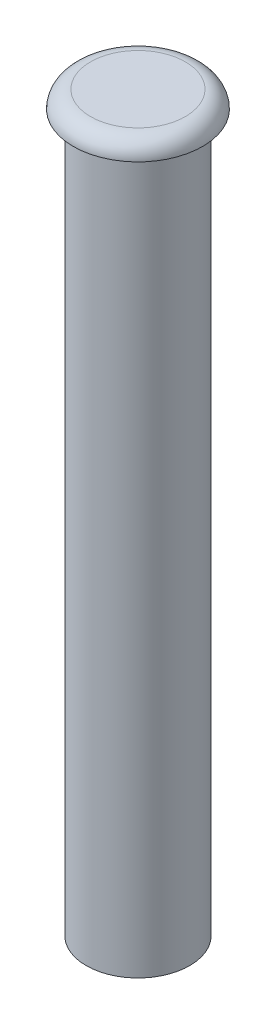
ISO-10303-21;
HEADER;
FILE_DESCRIPTION(('STEP AP214'),'2;1');
FILE_NAME('part.step','',(''),(''),'','','');
FILE_SCHEMA(('AUTOMOTIVE_DESIGN { 1 0 10303 214 1 1 1 1 }'));
ENDSEC;
DATA;
#1=APPLICATION_CONTEXT('core data for automotive mechanical design processes');
#2=APPLICATION_PROTOCOL_DEFINITION('international standard','automotive_design',2000,#1);
#3=PRODUCT_CONTEXT('',#1,'mechanical');
#4=PRODUCT('Part','Part','',(#3));
#5=PRODUCT_RELATED_PRODUCT_CATEGORY('part','',(#4));
#6=PRODUCT_DEFINITION_FORMATION('','',#4);
#7=PRODUCT_DEFINITION_CONTEXT('part definition',#1,'design');
#8=PRODUCT_DEFINITION('design','',#6,#7);
#9=PRODUCT_DEFINITION_SHAPE('','',#8);
#10=(LENGTH_UNIT() NAMED_UNIT(*) SI_UNIT(.MILLI.,.METRE.));
#11=(NAMED_UNIT(*) PLANE_ANGLE_UNIT() SI_UNIT($,.RADIAN.));
#12=(NAMED_UNIT(*) SI_UNIT($,.STERADIAN.) SOLID_ANGLE_UNIT());
#13=UNCERTAINTY_MEASURE_WITH_UNIT(LENGTH_MEASURE(1.E-05),#10,'distance_accuracy_value','');
#14=(GEOMETRIC_REPRESENTATION_CONTEXT(3) GLOBAL_UNCERTAINTY_ASSIGNED_CONTEXT((#13)) GLOBAL_UNIT_ASSIGNED_CONTEXT((#10,
#11,#12)) REPRESENTATION_CONTEXT('',''));
#15=CARTESIAN_POINT('',(0.,0.,0.));
#16=DIRECTION('',(0.,0.,1.));
#17=DIRECTION('',(1.,0.,0.));
#18=AXIS2_PLACEMENT_3D('',#15,#16,#17);
#19=CARTESIAN_POINT('',(0.,83.,0.));
#20=DIRECTION('',(0.,-1.,0.));
#21=DIRECTION('',(0.,0.,-1.));
#22=AXIS2_PLACEMENT_3D('',#19,#20,#21);
#23=CYLINDRICAL_SURFACE('',#22,6.);
#24=CARTESIAN_POINT('',(0.,83.,0.));
#25=DIRECTION('',(0.,1.,0.));
#26=DIRECTION('',(0.,0.,1.));
#27=AXIS2_PLACEMENT_3D('',#24,#25,#26);
#28=CIRCLE('',#27,6.);
#29=CARTESIAN_POINT('',(0.,83.,6.));
#30=VERTEX_POINT('',#29);
#31=EDGE_CURVE('E49',#30,#30,#28,.T.);
#32=ORIENTED_EDGE('',*,*,#31,.F.);
#33=EDGE_LOOP('',(#32));
#34=FACE_BOUND('',#33,.T.);
#35=CARTESIAN_POINT('',(0.,0.,0.));
#36=DIRECTION('',(0.,1.,0.));
#37=DIRECTION('',(0.,0.,1.));
#38=AXIS2_PLACEMENT_3D('',#35,#36,#37);
#39=CIRCLE('',#38,6.);
#40=CARTESIAN_POINT('',(0.,0.,6.));
#41=VERTEX_POINT('',#40);
#42=EDGE_CURVE('E54',#41,#41,#39,.T.);
#43=ORIENTED_EDGE('',*,*,#42,.T.);
#44=EDGE_LOOP('',(#43));
#45=FACE_BOUND('',#44,.T.);
#46=ADVANCED_FACE('F41',(#34,#45),#23,.T.);
#47=CARTESIAN_POINT('',(0.,0.,0.));
#48=DIRECTION('',(0.,1.,0.));
#49=DIRECTION('',(0.,0.,1.));
#50=AXIS2_PLACEMENT_3D('',#47,#48,#49);
#51=PLANE('',#50);
#52=CARTESIAN_POINT('',(0.,0.,0.));
#53=DIRECTION('',(0.,-1.,0.));
#54=DIRECTION('',(0.,0.,-1.));
#55=AXIS2_PLACEMENT_3D('',#52,#53,#54);
#56=CIRCLE('',#55,2.);
#57=CARTESIAN_POINT('',(0.,0.,-2.));
#58=VERTEX_POINT('',#57);
#59=EDGE_CURVE('E66',#58,#58,#56,.T.);
#60=ORIENTED_EDGE('',*,*,#59,.F.);
#61=EDGE_LOOP('',(#60));
#62=FACE_BOUND('',#61,.T.);
#63=ORIENTED_EDGE('',*,*,#42,.F.);
#64=EDGE_LOOP('',(#63));
#65=FACE_BOUND('',#64,.T.);
#66=ADVANCED_FACE('F82',(#62,#65),#51,.F.);
#67=CARTESIAN_POINT('',(0.,85.,0.));
#68=DIRECTION('',(0.,1.,0.));
#69=DIRECTION('',(0.,0.,1.));
#70=AXIS2_PLACEMENT_3D('',#67,#68,#69);
#71=PLANE('',#70);
#72=CARTESIAN_POINT('',(0.,85.,0.));
#73=DIRECTION('',(0.,1.,0.));
#74=DIRECTION('',(0.,0.,1.));
#75=AXIS2_PLACEMENT_3D('',#72,#73,#74);
#76=CIRCLE('',#75,5.5);
#77=CARTESIAN_POINT('',(0.,85.,5.5));
#78=VERTEX_POINT('',#77);
#79=EDGE_CURVE('E10',#78,#78,#76,.T.);
#80=ORIENTED_EDGE('',*,*,#79,.T.);
#81=EDGE_LOOP('',(#80));
#82=FACE_BOUND('',#81,.T.);
#83=ADVANCED_FACE('F85',(#82),#71,.T.);
#84=CARTESIAN_POINT('',(0.,83.,0.));
#85=DIRECTION('',(0.,1.,0.));
#86=DIRECTION('',(0.,0.,1.));
#87=AXIS2_PLACEMENT_3D('',#84,#85,#86);
#88=PLANE('',#87);
#89=ORIENTED_EDGE('',*,*,#31,.T.);
#90=EDGE_LOOP('',(#89));
#91=FACE_BOUND('',#90,.T.);
#92=CARTESIAN_POINT('',(0.,83.,0.));
#93=DIRECTION('',(0.,1.,0.));
#94=DIRECTION('',(0.,0.,1.));
#95=AXIS2_PLACEMENT_3D('',#92,#93,#94);
#96=CIRCLE('',#95,7.5);
#97=CARTESIAN_POINT('',(0.,83.,7.5));
#98=VERTEX_POINT('',#97);
#99=EDGE_CURVE('E60',#98,#98,#96,.T.);
#100=ORIENTED_EDGE('',*,*,#99,.F.);
#101=EDGE_LOOP('',(#100));
#102=FACE_BOUND('',#101,.T.);
#103=ADVANCED_FACE('F94',(#91,#102),#88,.F.);
#104=CARTESIAN_POINT('',(0.,83.,0.));
#105=DIRECTION('',(0.,1.,0.));
#106=DIRECTION('',(0.,0.,1.));
#107=AXIS2_PLACEMENT_3D('',#104,#105,#106);
#108=TOROIDAL_SURFACE('',#107,5.5,2.);
#109=ORIENTED_EDGE('',*,*,#99,.T.);
#110=EDGE_LOOP('',(#109));
#111=FACE_BOUND('',#110,.T.);
#112=ORIENTED_EDGE('',*,*,#79,.F.);
#113=EDGE_LOOP('',(#112));
#114=FACE_BOUND('',#113,.T.);
#115=ADVANCED_FACE('F43',(#111,#114),#108,.T.);
#116=CARTESIAN_POINT('',(0.,5.,0.));
#117=DIRECTION('',(0.,-1.,0.));
#118=DIRECTION('',(0.,0.,-1.));
#119=AXIS2_PLACEMENT_3D('',#116,#117,#118);
#120=CYLINDRICAL_SURFACE('',#119,2.);
#121=CARTESIAN_POINT('',(0.,5.,0.));
#122=DIRECTION('',(0.,-1.,0.));
#123=DIRECTION('',(0.,0.,-1.));
#124=AXIS2_PLACEMENT_3D('',#121,#122,#123);
#125=CIRCLE('',#124,2.);
#126=CARTESIAN_POINT('',(0.,5.,-2.));
#127=VERTEX_POINT('',#126);
#128=EDGE_CURVE('E65',#127,#127,#125,.T.);
#129=ORIENTED_EDGE('',*,*,#128,.F.);
#130=EDGE_LOOP('',(#129));
#131=FACE_BOUND('',#130,.T.);
#132=ORIENTED_EDGE('',*,*,#59,.T.);
#133=EDGE_LOOP('',(#132));
#134=FACE_BOUND('',#133,.T.);
#135=ADVANCED_FACE('F76',(#131,#134),#120,.F.);
#136=CARTESIAN_POINT('',(0.,5.,0.));
#137=DIRECTION('',(0.,-1.,0.));
#138=DIRECTION('',(0.,0.,-1.));
#139=AXIS2_PLACEMENT_3D('',#136,#137,#138);
#140=PLANE('',#139);
#141=ORIENTED_EDGE('',*,*,#128,.T.);
#142=EDGE_LOOP('',(#141));
#143=FACE_BOUND('',#142,.T.);
#144=ADVANCED_FACE('F74',(#143),#140,.T.);
#145=CLOSED_SHELL('',(#46,#66,#83,#103,#115,#135,#144));
#146=MANIFOLD_SOLID_BREP('B2',#145);
#147=ADVANCED_BREP_SHAPE_REPRESENTATION('',(#18,#146),#14);
#148=SHAPE_DEFINITION_REPRESENTATION(#9,#147);
ENDSEC;
END-ISO-10303-21;
